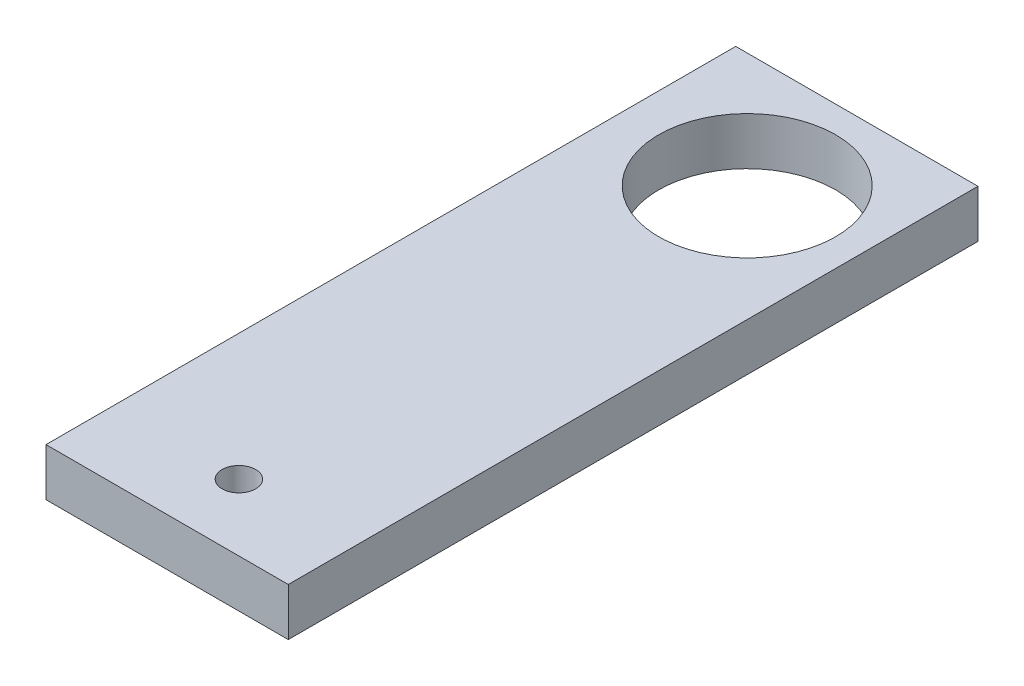
ISO-10303-21;
HEADER;
FILE_DESCRIPTION(('STEP AP214'),'2;1');
FILE_NAME('part.step','',(''),(''),'','','');
FILE_SCHEMA(('AUTOMOTIVE_DESIGN { 1 0 10303 214 1 1 1 1 }'));
ENDSEC;
DATA;
#1=APPLICATION_CONTEXT('core data for automotive mechanical design processes');
#2=APPLICATION_PROTOCOL_DEFINITION('international standard','automotive_design',2000,#1);
#3=PRODUCT_CONTEXT('',#1,'mechanical');
#4=PRODUCT('Part','Part','',(#3));
#5=PRODUCT_RELATED_PRODUCT_CATEGORY('part','',(#4));
#6=PRODUCT_DEFINITION_FORMATION('','',#4);
#7=PRODUCT_DEFINITION_CONTEXT('part definition',#1,'design');
#8=PRODUCT_DEFINITION('design','',#6,#7);
#9=PRODUCT_DEFINITION_SHAPE('','',#8);
#10=(LENGTH_UNIT() NAMED_UNIT(*) SI_UNIT(.MILLI.,.METRE.));
#11=(NAMED_UNIT(*) PLANE_ANGLE_UNIT() SI_UNIT($,.RADIAN.));
#12=(NAMED_UNIT(*) SI_UNIT($,.STERADIAN.) SOLID_ANGLE_UNIT());
#13=UNCERTAINTY_MEASURE_WITH_UNIT(LENGTH_MEASURE(1.E-05),#10,'distance_accuracy_value','');
#14=(GEOMETRIC_REPRESENTATION_CONTEXT(3) GLOBAL_UNCERTAINTY_ASSIGNED_CONTEXT((#13)) GLOBAL_UNIT_ASSIGNED_CONTEXT((#10,
#11,#12)) REPRESENTATION_CONTEXT('',''));
#15=CARTESIAN_POINT('',(0.,0.,0.));
#16=DIRECTION('',(0.,0.,1.));
#17=DIRECTION('',(1.,0.,0.));
#18=AXIS2_PLACEMENT_3D('',#15,#16,#17);
#19=CARTESIAN_POINT('',(3.27600000000001,1.35,-9.75));
#20=DIRECTION('',(-1.,0.,0.));
#21=DIRECTION('',(0.,0.,1.));
#22=AXIS2_PLACEMENT_3D('',#19,#20,#21);
#23=PLANE('',#22);
#24=DIRECTION('',(0.,0.,-1.));
#25=VECTOR('',#24,1.);
#26=CARTESIAN_POINT('',(3.27600000000001,0.,-9.75));
#27=LINE('',#26,#25);
#28=CARTESIAN_POINT('',(3.27600000000001,0.,9.75));
#29=VERTEX_POINT('',#28);
#30=CARTESIAN_POINT('',(3.27600000000001,0.,-9.75));
#31=VERTEX_POINT('',#30);
#32=EDGE_CURVE('E96',#29,#31,#27,.T.);
#33=ORIENTED_EDGE('',*,*,#32,.T.);
#34=DIRECTION('',(0.,-1.,0.));
#35=VECTOR('',#34,1.);
#36=CARTESIAN_POINT('',(3.27600000000001,1.35,-9.75));
#37=LINE('',#36,#35);
#38=CARTESIAN_POINT('',(3.27600000000001,1.35,-9.75));
#39=VERTEX_POINT('',#38);
#40=EDGE_CURVE('E11',#39,#31,#37,.T.);
#41=ORIENTED_EDGE('',*,*,#40,.F.);
#42=DIRECTION('',(0.,0.,-1.));
#43=VECTOR('',#42,1.);
#44=CARTESIAN_POINT('',(3.27600000000001,1.35,-9.75));
#45=LINE('',#44,#43);
#46=CARTESIAN_POINT('',(3.27600000000001,1.35,9.75));
#47=VERTEX_POINT('',#46);
#48=EDGE_CURVE('E84',#47,#39,#45,.T.);
#49=ORIENTED_EDGE('',*,*,#48,.F.);
#50=DIRECTION('',(0.,-1.,0.));
#51=VECTOR('',#50,1.);
#52=CARTESIAN_POINT('',(3.27600000000001,1.35,9.75));
#53=LINE('',#52,#51);
#54=EDGE_CURVE('E92',#47,#29,#53,.T.);
#55=ORIENTED_EDGE('',*,*,#54,.T.);
#56=EDGE_LOOP('',(#33,#41,#49,#55));
#57=FACE_BOUND('',#56,.T.);
#58=ADVANCED_FACE('F33',(#57),#23,.F.);
#59=CARTESIAN_POINT('',(-3.57399999999999,1.35,-9.75));
#60=DIRECTION('',(0.,0.,1.));
#61=DIRECTION('',(1.,0.,0.));
#62=AXIS2_PLACEMENT_3D('',#59,#60,#61);
#63=PLANE('',#62);
#64=DIRECTION('',(-1.,0.,0.));
#65=VECTOR('',#64,1.);
#66=CARTESIAN_POINT('',(-3.57399999999999,0.,-9.75));
#67=LINE('',#66,#65);
#68=CARTESIAN_POINT('',(-3.57399999999999,0.,-9.75));
#69=VERTEX_POINT('',#68);
#70=EDGE_CURVE('E88',#31,#69,#67,.T.);
#71=ORIENTED_EDGE('',*,*,#70,.T.);
#72=DIRECTION('',(0.,-1.,0.));
#73=VECTOR('',#72,1.);
#74=CARTESIAN_POINT('',(-3.57399999999999,1.35,-9.75));
#75=LINE('',#74,#73);
#76=CARTESIAN_POINT('',(-3.57399999999999,1.35,-9.75));
#77=VERTEX_POINT('',#76);
#78=EDGE_CURVE('E41',#77,#69,#75,.T.);
#79=ORIENTED_EDGE('',*,*,#78,.F.);
#80=DIRECTION('',(-1.,0.,0.));
#81=VECTOR('',#80,1.);
#82=CARTESIAN_POINT('',(-3.57399999999999,1.35,-9.75));
#83=LINE('',#82,#81);
#84=EDGE_CURVE('E79',#39,#77,#83,.T.);
#85=ORIENTED_EDGE('',*,*,#84,.F.);
#86=ORIENTED_EDGE('',*,*,#40,.T.);
#87=EDGE_LOOP('',(#71,#79,#85,#86));
#88=FACE_BOUND('',#87,.T.);
#89=ADVANCED_FACE('F87',(#88),#63,.F.);
#90=CARTESIAN_POINT('',(-3.57399999999999,1.35,-9.75));
#91=DIRECTION('',(1.,0.,0.));
#92=DIRECTION('',(0.,0.,-1.));
#93=AXIS2_PLACEMENT_3D('',#90,#91,#92);
#94=PLANE('',#93);
#95=DIRECTION('',(0.,0.,1.));
#96=VECTOR('',#95,1.);
#97=CARTESIAN_POINT('',(-3.57399999999999,0.,-9.75));
#98=LINE('',#97,#96);
#99=CARTESIAN_POINT('',(-3.57399999999999,0.,9.75));
#100=VERTEX_POINT('',#99);
#101=EDGE_CURVE('E66',#69,#100,#98,.T.);
#102=ORIENTED_EDGE('',*,*,#101,.T.);
#103=DIRECTION('',(0.,-1.,0.));
#104=VECTOR('',#103,1.);
#105=CARTESIAN_POINT('',(-3.57399999999999,1.35,9.75));
#106=LINE('',#105,#104);
#107=CARTESIAN_POINT('',(-3.57399999999999,1.35,9.75));
#108=VERTEX_POINT('',#107);
#109=EDGE_CURVE('E89',#108,#100,#106,.T.);
#110=ORIENTED_EDGE('',*,*,#109,.F.);
#111=DIRECTION('',(0.,0.,1.));
#112=VECTOR('',#111,1.);
#113=CARTESIAN_POINT('',(-3.57399999999999,1.35,-9.75));
#114=LINE('',#113,#112);
#115=EDGE_CURVE('E82',#77,#108,#114,.T.);
#116=ORIENTED_EDGE('',*,*,#115,.F.);
#117=ORIENTED_EDGE('',*,*,#78,.T.);
#118=EDGE_LOOP('',(#102,#110,#116,#117));
#119=FACE_BOUND('',#118,.T.);
#120=ADVANCED_FACE('F90',(#119),#94,.F.);
#121=CARTESIAN_POINT('',(-3.57399999999999,1.35,9.75));
#122=DIRECTION('',(0.,0.,-1.));
#123=DIRECTION('',(-1.,0.,0.));
#124=AXIS2_PLACEMENT_3D('',#121,#122,#123);
#125=PLANE('',#124);
#126=DIRECTION('',(1.,0.,0.));
#127=VECTOR('',#126,1.);
#128=CARTESIAN_POINT('',(-3.57399999999999,0.,9.75));
#129=LINE('',#128,#127);
#130=EDGE_CURVE('E72',#100,#29,#129,.T.);
#131=ORIENTED_EDGE('',*,*,#130,.T.);
#132=ORIENTED_EDGE('',*,*,#54,.F.);
#133=DIRECTION('',(1.,0.,0.));
#134=VECTOR('',#133,1.);
#135=CARTESIAN_POINT('',(-3.57399999999999,1.35,9.75));
#136=LINE('',#135,#134);
#137=EDGE_CURVE('E49',#108,#47,#136,.T.);
#138=ORIENTED_EDGE('',*,*,#137,.F.);
#139=ORIENTED_EDGE('',*,*,#109,.T.);
#140=EDGE_LOOP('',(#131,#132,#138,#139));
#141=FACE_BOUND('',#140,.T.);
#142=ADVANCED_FACE('F104',(#141),#125,.F.);
#143=CARTESIAN_POINT('',(0.,1.35,0.));
#144=DIRECTION('',(0.,1.,0.));
#145=DIRECTION('',(0.,0.,1.));
#146=AXIS2_PLACEMENT_3D('',#143,#144,#145);
#147=PLANE('',#146);
#148=CARTESIAN_POINT('',(0.,1.35,7.87));
#149=DIRECTION('',(0.,1.,0.));
#150=DIRECTION('',(0.,0.,1.));
#151=AXIS2_PLACEMENT_3D('',#148,#149,#150);
#152=CIRCLE('',#151,0.475);
#153=CARTESIAN_POINT('',(0.,1.35,8.345));
#154=VERTEX_POINT('',#153);
#155=EDGE_CURVE('E116',#154,#154,#152,.T.);
#156=ORIENTED_EDGE('',*,*,#155,.F.);
#157=EDGE_LOOP('',(#156));
#158=FACE_BOUND('',#157,.T.);
#159=CARTESIAN_POINT('',(0.,1.35,-6.5));
#160=DIRECTION('',(0.,-1.,0.));
#161=DIRECTION('',(0.,0.,-1.));
#162=AXIS2_PLACEMENT_3D('',#159,#160,#161);
#163=CIRCLE('',#162,2.5);
#164=CARTESIAN_POINT('',(0.,1.35,-9.));
#165=VERTEX_POINT('',#164);
#166=EDGE_CURVE('E99',#165,#165,#163,.T.);
#167=ORIENTED_EDGE('',*,*,#166,.T.);
#168=EDGE_LOOP('',(#167));
#169=FACE_BOUND('',#168,.T.);
#170=ORIENTED_EDGE('',*,*,#48,.T.);
#171=ORIENTED_EDGE('',*,*,#84,.T.);
#172=ORIENTED_EDGE('',*,*,#115,.T.);
#173=ORIENTED_EDGE('',*,*,#137,.T.);
#174=EDGE_LOOP('',(#170,#171,#172,#173));
#175=FACE_BOUND('',#174,.T.);
#176=ADVANCED_FACE('F80',(#158,#169,#175),#147,.T.);
#177=CARTESIAN_POINT('',(0.,0.,0.));
#178=DIRECTION('',(0.,1.,0.));
#179=DIRECTION('',(0.,0.,1.));
#180=AXIS2_PLACEMENT_3D('',#177,#178,#179);
#181=PLANE('',#180);
#182=CARTESIAN_POINT('',(0.,0.,7.87));
#183=DIRECTION('',(0.,1.,0.));
#184=DIRECTION('',(0.,0.,1.));
#185=AXIS2_PLACEMENT_3D('',#182,#183,#184);
#186=CIRCLE('',#185,0.475);
#187=CARTESIAN_POINT('',(0.,0.,8.345));
#188=VERTEX_POINT('',#187);
#189=EDGE_CURVE('E113',#188,#188,#186,.T.);
#190=ORIENTED_EDGE('',*,*,#189,.T.);
#191=EDGE_LOOP('',(#190));
#192=FACE_BOUND('',#191,.T.);
#193=CARTESIAN_POINT('',(0.,0.,-6.5));
#194=DIRECTION('',(0.,-1.,0.));
#195=DIRECTION('',(0.,0.,-1.));
#196=AXIS2_PLACEMENT_3D('',#193,#194,#195);
#197=CIRCLE('',#196,2.5);
#198=CARTESIAN_POINT('',(0.,0.,-9.));
#199=VERTEX_POINT('',#198);
#200=EDGE_CURVE('E110',#199,#199,#197,.T.);
#201=ORIENTED_EDGE('',*,*,#200,.F.);
#202=EDGE_LOOP('',(#201));
#203=FACE_BOUND('',#202,.T.);
#204=ORIENTED_EDGE('',*,*,#32,.F.);
#205=ORIENTED_EDGE('',*,*,#130,.F.);
#206=ORIENTED_EDGE('',*,*,#101,.F.);
#207=ORIENTED_EDGE('',*,*,#70,.F.);
#208=EDGE_LOOP('',(#204,#205,#206,#207));
#209=FACE_BOUND('',#208,.T.);
#210=ADVANCED_FACE('F107',(#192,#203,#209),#181,.F.);
#211=CARTESIAN_POINT('',(0.,1.35,-6.5));
#212=DIRECTION('',(0.,-1.,0.));
#213=DIRECTION('',(0.,0.,-1.));
#214=AXIS2_PLACEMENT_3D('',#211,#212,#213);
#215=CYLINDRICAL_SURFACE('',#214,2.5);
#216=ORIENTED_EDGE('',*,*,#166,.F.);
#217=EDGE_LOOP('',(#216));
#218=FACE_BOUND('',#217,.T.);
#219=ORIENTED_EDGE('',*,*,#200,.T.);
#220=EDGE_LOOP('',(#219));
#221=FACE_BOUND('',#220,.T.);
#222=ADVANCED_FACE('F127',(#218,#221),#215,.F.);
#223=CARTESIAN_POINT('',(0.,0.,7.87));
#224=DIRECTION('',(0.,1.,0.));
#225=DIRECTION('',(0.,0.,1.));
#226=AXIS2_PLACEMENT_3D('',#223,#224,#225);
#227=CYLINDRICAL_SURFACE('',#226,0.475);
#228=ORIENTED_EDGE('',*,*,#189,.F.);
#229=EDGE_LOOP('',(#228));
#230=FACE_BOUND('',#229,.T.);
#231=ORIENTED_EDGE('',*,*,#155,.T.);
#232=EDGE_LOOP('',(#231));
#233=FACE_BOUND('',#232,.T.);
#234=ADVANCED_FACE('F124',(#230,#233),#227,.F.);
#235=CLOSED_SHELL('',(#58,#89,#120,#142,#176,#210,#222,#234));
#236=MANIFOLD_SOLID_BREP('B2',#235);
#237=ADVANCED_BREP_SHAPE_REPRESENTATION('',(#18,#236),#14);
#238=SHAPE_DEFINITION_REPRESENTATION(#9,#237);
ENDSEC;
END-ISO-10303-21;
